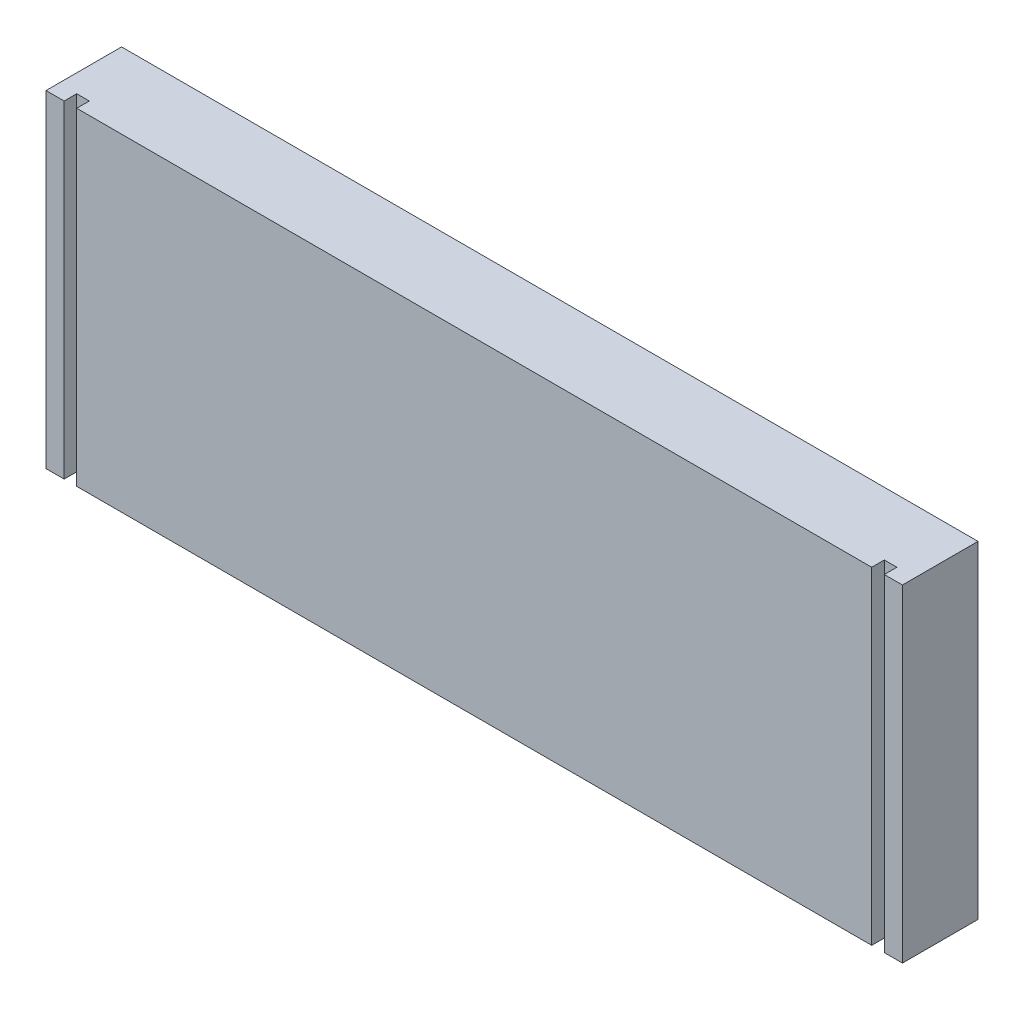
ISO-10303-21;
HEADER;
FILE_DESCRIPTION(('STEP AP214'),'2;1');
FILE_NAME('part.step','',(''),(''),'','','');
FILE_SCHEMA(('AUTOMOTIVE_DESIGN { 1 0 10303 214 1 1 1 1 }'));
ENDSEC;
DATA;
#1=APPLICATION_CONTEXT('core data for automotive mechanical design processes');
#2=APPLICATION_PROTOCOL_DEFINITION('international standard','automotive_design',2000,#1);
#3=PRODUCT_CONTEXT('',#1,'mechanical');
#4=PRODUCT('Part','Part','',(#3));
#5=PRODUCT_RELATED_PRODUCT_CATEGORY('part','',(#4));
#6=PRODUCT_DEFINITION_FORMATION('','',#4);
#7=PRODUCT_DEFINITION_CONTEXT('part definition',#1,'design');
#8=PRODUCT_DEFINITION('design','',#6,#7);
#9=PRODUCT_DEFINITION_SHAPE('','',#8);
#10=(LENGTH_UNIT() NAMED_UNIT(*) SI_UNIT(.MILLI.,.METRE.));
#11=(NAMED_UNIT(*) PLANE_ANGLE_UNIT() SI_UNIT($,.RADIAN.));
#12=(NAMED_UNIT(*) SI_UNIT($,.STERADIAN.) SOLID_ANGLE_UNIT());
#13=UNCERTAINTY_MEASURE_WITH_UNIT(LENGTH_MEASURE(1.E-05),#10,'distance_accuracy_value','');
#14=(GEOMETRIC_REPRESENTATION_CONTEXT(3) GLOBAL_UNCERTAINTY_ASSIGNED_CONTEXT((#13)) GLOBAL_UNIT_ASSIGNED_CONTEXT((#10,
#11,#12)) REPRESENTATION_CONTEXT('',''));
#15=CARTESIAN_POINT('',(0.,0.,0.));
#16=DIRECTION('',(0.,0.,1.));
#17=DIRECTION('',(1.,0.,0.));
#18=AXIS2_PLACEMENT_3D('',#15,#16,#17);
#19=CARTESIAN_POINT('',(-107.95,-41.275,19.05));
#20=DIRECTION('',(0.,1.,0.));
#21=DIRECTION('',(0.,0.,1.));
#22=AXIS2_PLACEMENT_3D('',#19,#20,#21);
#23=PLANE('',#22);
#24=CARTESIAN_POINT('',(-82.55,-41.275,9.525));
#25=DIRECTION('',(0.,-1.,0.));
#26=DIRECTION('',(0.,0.,-1.));
#27=AXIS2_PLACEMENT_3D('',#24,#25,#26);
#28=CIRCLE('',#27,4.7625);
#29=CARTESIAN_POINT('',(-82.55,-41.275,4.7625));
#30=VERTEX_POINT('',#29);
#31=EDGE_CURVE('E291',#30,#30,#28,.T.);
#32=ORIENTED_EDGE('',*,*,#31,.F.);
#33=EDGE_LOOP('',(#32));
#34=FACE_BOUND('',#33,.T.);
#35=CARTESIAN_POINT('',(82.55,-41.275,9.525));
#36=DIRECTION('',(0.,1.,0.));
#37=DIRECTION('',(0.,0.,-1.));
#38=AXIS2_PLACEMENT_3D('',#35,#36,#37);
#39=CIRCLE('',#38,4.7625);
#40=CARTESIAN_POINT('',(82.55,-41.275,4.7625));
#41=VERTEX_POINT('',#40);
#42=EDGE_CURVE('E259',#41,#41,#39,.T.);
#43=ORIENTED_EDGE('',*,*,#42,.T.);
#44=EDGE_LOOP('',(#43));
#45=FACE_BOUND('',#44,.T.);
#46=DIRECTION('',(0.,0.,-1.));
#47=VECTOR('',#46,1.);
#48=CARTESIAN_POINT('',(103.378,-41.275,19.05));
#49=LINE('',#48,#47);
#50=CARTESIAN_POINT('',(103.378,-41.275,19.05));
#51=VERTEX_POINT('',#50);
#52=CARTESIAN_POINT('',(103.378,-41.275,15.875));
#53=VERTEX_POINT('',#52);
#54=EDGE_CURVE('E133',#51,#53,#49,.T.);
#55=ORIENTED_EDGE('',*,*,#54,.T.);
#56=DIRECTION('',(-1.,0.,0.));
#57=VECTOR('',#56,1.);
#58=CARTESIAN_POINT('',(103.378,-41.275,15.875));
#59=LINE('',#58,#57);
#60=CARTESIAN_POINT('',(100.203,-41.275,15.875));
#61=VERTEX_POINT('',#60);
#62=EDGE_CURVE('E145',#53,#61,#59,.T.);
#63=ORIENTED_EDGE('',*,*,#62,.T.);
#64=DIRECTION('',(0.,0.,1.));
#65=VECTOR('',#64,1.);
#66=CARTESIAN_POINT('',(100.203,-41.275,19.05));
#67=LINE('',#66,#65);
#68=CARTESIAN_POINT('',(100.203,-41.275,19.05));
#69=VERTEX_POINT('',#68);
#70=EDGE_CURVE('E257',#61,#69,#67,.T.);
#71=ORIENTED_EDGE('',*,*,#70,.T.);
#72=DIRECTION('',(1.,0.,0.));
#73=VECTOR('',#72,1.);
#74=CARTESIAN_POINT('',(-107.95,-41.275,19.05));
#75=LINE('',#74,#73);
#76=CARTESIAN_POINT('',(-100.203,-41.275,19.05));
#77=VERTEX_POINT('',#76);
#78=EDGE_CURVE('E164',#77,#69,#75,.T.);
#79=ORIENTED_EDGE('',*,*,#78,.F.);
#80=DIRECTION('',(0.,0.,1.));
#81=VECTOR('',#80,1.);
#82=CARTESIAN_POINT('',(-100.203,-41.275,19.05));
#83=LINE('',#82,#81);
#84=CARTESIAN_POINT('',(-100.203,-41.275,15.875));
#85=VERTEX_POINT('',#84);
#86=EDGE_CURVE('E61',#85,#77,#83,.T.);
#87=ORIENTED_EDGE('',*,*,#86,.F.);
#88=DIRECTION('',(1.,0.,0.));
#89=VECTOR('',#88,1.);
#90=CARTESIAN_POINT('',(-103.378,-41.275,15.875));
#91=LINE('',#90,#89);
#92=CARTESIAN_POINT('',(-103.378,-41.275,15.875));
#93=VERTEX_POINT('',#92);
#94=EDGE_CURVE('E285',#93,#85,#91,.T.);
#95=ORIENTED_EDGE('',*,*,#94,.F.);
#96=DIRECTION('',(0.,0.,-1.));
#97=VECTOR('',#96,1.);
#98=CARTESIAN_POINT('',(-103.378,-41.275,19.05));
#99=LINE('',#98,#97);
#100=CARTESIAN_POINT('',(-103.378,-41.275,19.05));
#101=VERTEX_POINT('',#100);
#102=EDGE_CURVE('E271',#101,#93,#99,.T.);
#103=ORIENTED_EDGE('',*,*,#102,.F.);
#104=CARTESIAN_POINT('',(-107.95,-41.275,19.05));
#105=VERTEX_POINT('',#104);
#106=EDGE_CURVE('E166',#105,#101,#75,.T.);
#107=ORIENTED_EDGE('',*,*,#106,.F.);
#108=DIRECTION('',(0.,0.,-1.));
#109=VECTOR('',#108,1.);
#110=CARTESIAN_POINT('',(-107.95,-41.275,19.05));
#111=LINE('',#110,#109);
#112=CARTESIAN_POINT('',(-107.95,-41.275,0.));
#113=VERTEX_POINT('',#112);
#114=EDGE_CURVE('E11',#105,#113,#111,.T.);
#115=ORIENTED_EDGE('',*,*,#114,.T.);
#116=DIRECTION('',(1.,0.,0.));
#117=VECTOR('',#116,1.);
#118=CARTESIAN_POINT('',(-107.95,-41.275,0.));
#119=LINE('',#118,#117);
#120=CARTESIAN_POINT('',(107.95,-41.275,0.));
#121=VERTEX_POINT('',#120);
#122=EDGE_CURVE('E157',#113,#121,#119,.T.);
#123=ORIENTED_EDGE('',*,*,#122,.T.);
#124=DIRECTION('',(0.,0.,-1.));
#125=VECTOR('',#124,1.);
#126=CARTESIAN_POINT('',(107.95,-41.275,19.05));
#127=LINE('',#126,#125);
#128=CARTESIAN_POINT('',(107.95,-41.275,19.05));
#129=VERTEX_POINT('',#128);
#130=EDGE_CURVE('E45',#129,#121,#127,.T.);
#131=ORIENTED_EDGE('',*,*,#130,.F.);
#132=EDGE_CURVE('E163',#51,#129,#75,.T.);
#133=ORIENTED_EDGE('',*,*,#132,.F.);
#134=EDGE_LOOP('',(#55,#63,#71,#79,#87,#95,#103,#107,#115,#123,#131,#133));
#135=FACE_BOUND('',#134,.T.);
#136=ADVANCED_FACE('F36',(#34,#45,#135),#23,.F.);
#137=CARTESIAN_POINT('',(-107.95,41.275,19.05));
#138=DIRECTION('',(0.,1.,0.));
#139=DIRECTION('',(0.,0.,1.));
#140=AXIS2_PLACEMENT_3D('',#137,#138,#139);
#141=PLANE('',#140);
#142=DIRECTION('',(-1.,0.,0.));
#143=VECTOR('',#142,1.);
#144=CARTESIAN_POINT('',(103.378,41.275,15.875));
#145=LINE('',#144,#143);
#146=CARTESIAN_POINT('',(103.378,41.275,15.875));
#147=VERTEX_POINT('',#146);
#148=CARTESIAN_POINT('',(100.203,41.275,15.875));
#149=VERTEX_POINT('',#148);
#150=EDGE_CURVE('E138',#147,#149,#145,.T.);
#151=ORIENTED_EDGE('',*,*,#150,.F.);
#152=DIRECTION('',(0.,0.,-1.));
#153=VECTOR('',#152,1.);
#154=CARTESIAN_POINT('',(103.378,41.275,19.05));
#155=LINE('',#154,#153);
#156=CARTESIAN_POINT('',(103.378,41.275,19.05));
#157=VERTEX_POINT('',#156);
#158=EDGE_CURVE('E130',#157,#147,#155,.T.);
#159=ORIENTED_EDGE('',*,*,#158,.F.);
#160=DIRECTION('',(1.,0.,0.));
#161=VECTOR('',#160,1.);
#162=CARTESIAN_POINT('',(-107.95,41.275,19.05));
#163=LINE('',#162,#161);
#164=CARTESIAN_POINT('',(107.95,41.275,19.05));
#165=VERTEX_POINT('',#164);
#166=EDGE_CURVE('E143',#157,#165,#163,.T.);
#167=ORIENTED_EDGE('',*,*,#166,.T.);
#168=DIRECTION('',(0.,0.,-1.));
#169=VECTOR('',#168,1.);
#170=CARTESIAN_POINT('',(107.95,41.275,19.05));
#171=LINE('',#170,#169);
#172=CARTESIAN_POINT('',(107.95,41.275,0.));
#173=VERTEX_POINT('',#172);
#174=EDGE_CURVE('E181',#165,#173,#171,.T.);
#175=ORIENTED_EDGE('',*,*,#174,.T.);
#176=DIRECTION('',(1.,0.,0.));
#177=VECTOR('',#176,1.);
#178=CARTESIAN_POINT('',(-107.95,41.275,0.));
#179=LINE('',#178,#177);
#180=CARTESIAN_POINT('',(-107.95,41.275,0.));
#181=VERTEX_POINT('',#180);
#182=EDGE_CURVE('E172',#181,#173,#179,.T.);
#183=ORIENTED_EDGE('',*,*,#182,.F.);
#184=DIRECTION('',(0.,0.,-1.));
#185=VECTOR('',#184,1.);
#186=CARTESIAN_POINT('',(-107.95,41.275,19.05));
#187=LINE('',#186,#185);
#188=CARTESIAN_POINT('',(-107.95,41.275,19.05));
#189=VERTEX_POINT('',#188);
#190=EDGE_CURVE('E40',#189,#181,#187,.T.);
#191=ORIENTED_EDGE('',*,*,#190,.F.);
#192=CARTESIAN_POINT('',(-103.378,41.275,19.05));
#193=VERTEX_POINT('',#192);
#194=EDGE_CURVE('E154',#189,#193,#163,.T.);
#195=ORIENTED_EDGE('',*,*,#194,.T.);
#196=DIRECTION('',(0.,0.,-1.));
#197=VECTOR('',#196,1.);
#198=CARTESIAN_POINT('',(-103.378,41.275,19.05));
#199=LINE('',#198,#197);
#200=CARTESIAN_POINT('',(-103.378,41.275,15.875));
#201=VERTEX_POINT('',#200);
#202=EDGE_CURVE('E274',#193,#201,#199,.T.);
#203=ORIENTED_EDGE('',*,*,#202,.T.);
#204=DIRECTION('',(1.,0.,0.));
#205=VECTOR('',#204,1.);
#206=CARTESIAN_POINT('',(-103.378,41.275,15.875));
#207=LINE('',#206,#205);
#208=CARTESIAN_POINT('',(-100.203,41.275,15.875));
#209=VERTEX_POINT('',#208);
#210=EDGE_CURVE('E276',#201,#209,#207,.T.);
#211=ORIENTED_EDGE('',*,*,#210,.T.);
#212=DIRECTION('',(0.,0.,1.));
#213=VECTOR('',#212,1.);
#214=CARTESIAN_POINT('',(-100.203,41.275,19.05));
#215=LINE('',#214,#213);
#216=CARTESIAN_POINT('',(-100.203,41.275,19.05));
#217=VERTEX_POINT('',#216);
#218=EDGE_CURVE('E279',#209,#217,#215,.T.);
#219=ORIENTED_EDGE('',*,*,#218,.T.);
#220=CARTESIAN_POINT('',(100.203,41.275,19.05));
#221=VERTEX_POINT('',#220);
#222=EDGE_CURVE('E151',#217,#221,#163,.T.);
#223=ORIENTED_EDGE('',*,*,#222,.T.);
#224=DIRECTION('',(0.,0.,1.));
#225=VECTOR('',#224,1.);
#226=CARTESIAN_POINT('',(100.203,41.275,19.05));
#227=LINE('',#226,#225);
#228=EDGE_CURVE('E53',#149,#221,#227,.T.);
#229=ORIENTED_EDGE('',*,*,#228,.F.);
#230=EDGE_LOOP('',(#151,#159,#167,#175,#183,#191,#195,#203,#211,#219,#223,#229));
#231=FACE_BOUND('',#230,.T.);
#232=ADVANCED_FACE('F142',(#231),#141,.T.);
#233=CARTESIAN_POINT('',(0.,0.,19.05));
#234=DIRECTION('',(0.,0.,-1.));
#235=DIRECTION('',(-1.,0.,0.));
#236=AXIS2_PLACEMENT_3D('',#233,#234,#235);
#237=PLANE('',#236);
#238=DIRECTION('',(0.,-1.,0.));
#239=VECTOR('',#238,1.);
#240=CARTESIAN_POINT('',(103.378,41.275,19.05));
#241=LINE('',#240,#239);
#242=EDGE_CURVE('E126',#157,#51,#241,.T.);
#243=ORIENTED_EDGE('',*,*,#242,.T.);
#244=ORIENTED_EDGE('',*,*,#132,.T.);
#245=DIRECTION('',(0.,1.,0.));
#246=VECTOR('',#245,1.);
#247=CARTESIAN_POINT('',(107.95,-41.275,19.05));
#248=LINE('',#247,#246);
#249=EDGE_CURVE('E149',#129,#165,#248,.T.);
#250=ORIENTED_EDGE('',*,*,#249,.T.);
#251=ORIENTED_EDGE('',*,*,#166,.F.);
#252=EDGE_LOOP('',(#243,#244,#250,#251));
#253=FACE_BOUND('',#252,.T.);
#254=ADVANCED_FACE('F147',(#253),#237,.F.);
#255=DIRECTION('',(0.,-1.,0.));
#256=VECTOR('',#255,1.);
#257=CARTESIAN_POINT('',(100.203,41.275,19.05));
#258=LINE('',#257,#256);
#259=EDGE_CURVE('E137',#221,#69,#258,.T.);
#260=ORIENTED_EDGE('',*,*,#259,.F.);
#261=ORIENTED_EDGE('',*,*,#222,.F.);
#262=DIRECTION('',(0.,-1.,0.));
#263=VECTOR('',#262,1.);
#264=CARTESIAN_POINT('',(-100.203,41.275,19.05));
#265=LINE('',#264,#263);
#266=EDGE_CURVE('E292',#217,#77,#265,.T.);
#267=ORIENTED_EDGE('',*,*,#266,.T.);
#268=ORIENTED_EDGE('',*,*,#78,.T.);
#269=EDGE_LOOP('',(#260,#261,#267,#268));
#270=FACE_BOUND('',#269,.T.);
#271=ADVANCED_FACE('F215',(#270),#237,.F.);
#272=ORIENTED_EDGE('',*,*,#106,.T.);
#273=DIRECTION('',(0.,-1.,0.));
#274=VECTOR('',#273,1.);
#275=CARTESIAN_POINT('',(-103.378,41.275,19.05));
#276=LINE('',#275,#274);
#277=EDGE_CURVE('E289',#193,#101,#276,.T.);
#278=ORIENTED_EDGE('',*,*,#277,.F.);
#279=ORIENTED_EDGE('',*,*,#194,.F.);
#280=DIRECTION('',(0.,1.,0.));
#281=VECTOR('',#280,1.);
#282=CARTESIAN_POINT('',(-107.95,-41.275,19.05));
#283=LINE('',#282,#281);
#284=EDGE_CURVE('E152',#105,#189,#283,.T.);
#285=ORIENTED_EDGE('',*,*,#284,.F.);
#286=EDGE_LOOP('',(#272,#278,#279,#285));
#287=FACE_BOUND('',#286,.T.);
#288=ADVANCED_FACE('F203',(#287),#237,.F.);
#289=CARTESIAN_POINT('',(-107.95,-41.275,19.05));
#290=DIRECTION('',(-1.,0.,0.));
#291=DIRECTION('',(0.,0.,1.));
#292=AXIS2_PLACEMENT_3D('',#289,#290,#291);
#293=PLANE('',#292);
#294=DIRECTION('',(0.,1.,0.));
#295=VECTOR('',#294,1.);
#296=CARTESIAN_POINT('',(-107.95,-41.275,0.));
#297=LINE('',#296,#295);
#298=EDGE_CURVE('E169',#113,#181,#297,.T.);
#299=ORIENTED_EDGE('',*,*,#298,.F.);
#300=ORIENTED_EDGE('',*,*,#114,.F.);
#301=ORIENTED_EDGE('',*,*,#284,.T.);
#302=ORIENTED_EDGE('',*,*,#190,.T.);
#303=EDGE_LOOP('',(#299,#300,#301,#302));
#304=FACE_BOUND('',#303,.T.);
#305=ADVANCED_FACE('F38',(#304),#293,.T.);
#306=CARTESIAN_POINT('',(107.95,-41.275,19.05));
#307=DIRECTION('',(-1.,0.,0.));
#308=DIRECTION('',(0.,0.,1.));
#309=AXIS2_PLACEMENT_3D('',#306,#307,#308);
#310=PLANE('',#309);
#311=DIRECTION('',(0.,1.,0.));
#312=VECTOR('',#311,1.);
#313=CARTESIAN_POINT('',(107.95,-41.275,0.));
#314=LINE('',#313,#312);
#315=EDGE_CURVE('E176',#121,#173,#314,.T.);
#316=ORIENTED_EDGE('',*,*,#315,.T.);
#317=ORIENTED_EDGE('',*,*,#174,.F.);
#318=ORIENTED_EDGE('',*,*,#249,.F.);
#319=ORIENTED_EDGE('',*,*,#130,.T.);
#320=EDGE_LOOP('',(#316,#317,#318,#319));
#321=FACE_BOUND('',#320,.T.);
#322=ADVANCED_FACE('F194',(#321),#310,.F.);
#323=CARTESIAN_POINT('',(0.,0.,0.));
#324=DIRECTION('',(0.,0.,-1.));
#325=DIRECTION('',(-1.,0.,0.));
#326=AXIS2_PLACEMENT_3D('',#323,#324,#325);
#327=PLANE('',#326);
#328=ORIENTED_EDGE('',*,*,#298,.T.);
#329=ORIENTED_EDGE('',*,*,#182,.T.);
#330=ORIENTED_EDGE('',*,*,#315,.F.);
#331=ORIENTED_EDGE('',*,*,#122,.F.);
#332=EDGE_LOOP('',(#328,#329,#330,#331));
#333=FACE_BOUND('',#332,.T.);
#334=ADVANCED_FACE('F189',(#333),#327,.T.);
#335=CARTESIAN_POINT('',(-82.55,-22.225,9.525));
#336=DIRECTION('',(0.,-1.,0.));
#337=DIRECTION('',(0.,0.,-1.));
#338=AXIS2_PLACEMENT_3D('',#335,#336,#337);
#339=CYLINDRICAL_SURFACE('',#338,4.7625);
#340=CARTESIAN_POINT('',(-82.55,-22.225,9.525));
#341=DIRECTION('',(0.,-1.,0.));
#342=DIRECTION('',(0.,0.,-1.));
#343=AXIS2_PLACEMENT_3D('',#340,#341,#342);
#344=CIRCLE('',#343,4.7625);
#345=CARTESIAN_POINT('',(-82.55,-22.225,4.7625));
#346=VERTEX_POINT('',#345);
#347=EDGE_CURVE('E173',#346,#346,#344,.T.);
#348=ORIENTED_EDGE('',*,*,#347,.F.);
#349=EDGE_LOOP('',(#348));
#350=FACE_BOUND('',#349,.T.);
#351=ORIENTED_EDGE('',*,*,#31,.T.);
#352=EDGE_LOOP('',(#351));
#353=FACE_BOUND('',#352,.T.);
#354=ADVANCED_FACE('F201',(#350,#353),#339,.F.);
#355=CARTESIAN_POINT('',(-82.55,-22.225,9.525));
#356=DIRECTION('',(0.,-1.,0.));
#357=DIRECTION('',(0.,0.,-1.));
#358=AXIS2_PLACEMENT_3D('',#355,#356,#357);
#359=PLANE('',#358);
#360=ORIENTED_EDGE('',*,*,#347,.T.);
#361=EDGE_LOOP('',(#360));
#362=FACE_BOUND('',#361,.T.);
#363=ADVANCED_FACE('F218',(#362),#359,.T.);
#364=CARTESIAN_POINT('',(-103.378,41.275,19.05));
#365=DIRECTION('',(-1.,0.,0.));
#366=DIRECTION('',(0.,0.,1.));
#367=AXIS2_PLACEMENT_3D('',#364,#365,#366);
#368=PLANE('',#367);
#369=ORIENTED_EDGE('',*,*,#102,.T.);
#370=DIRECTION('',(0.,-1.,0.));
#371=VECTOR('',#370,1.);
#372=CARTESIAN_POINT('',(-103.378,41.275,15.875));
#373=LINE('',#372,#371);
#374=EDGE_CURVE('E282',#201,#93,#373,.T.);
#375=ORIENTED_EDGE('',*,*,#374,.F.);
#376=ORIENTED_EDGE('',*,*,#202,.F.);
#377=ORIENTED_EDGE('',*,*,#277,.T.);
#378=EDGE_LOOP('',(#369,#375,#376,#377));
#379=FACE_BOUND('',#378,.T.);
#380=ADVANCED_FACE('F222',(#379),#368,.F.);
#381=CARTESIAN_POINT('',(-100.203,41.275,19.05));
#382=DIRECTION('',(1.,0.,0.));
#383=DIRECTION('',(0.,0.,-1.));
#384=AXIS2_PLACEMENT_3D('',#381,#382,#383);
#385=PLANE('',#384);
#386=ORIENTED_EDGE('',*,*,#86,.T.);
#387=ORIENTED_EDGE('',*,*,#266,.F.);
#388=ORIENTED_EDGE('',*,*,#218,.F.);
#389=DIRECTION('',(0.,-1.,0.));
#390=VECTOR('',#389,1.);
#391=CARTESIAN_POINT('',(-100.203,41.275,15.875));
#392=LINE('',#391,#390);
#393=EDGE_CURVE('E294',#209,#85,#392,.T.);
#394=ORIENTED_EDGE('',*,*,#393,.T.);
#395=EDGE_LOOP('',(#386,#387,#388,#394));
#396=FACE_BOUND('',#395,.T.);
#397=ADVANCED_FACE('F226',(#396),#385,.F.);
#398=CARTESIAN_POINT('',(-103.378,41.275,15.875));
#399=DIRECTION('',(0.,0.,-1.));
#400=DIRECTION('',(-1.,0.,0.));
#401=AXIS2_PLACEMENT_3D('',#398,#399,#400);
#402=PLANE('',#401);
#403=ORIENTED_EDGE('',*,*,#94,.T.);
#404=ORIENTED_EDGE('',*,*,#393,.F.);
#405=ORIENTED_EDGE('',*,*,#210,.F.);
#406=ORIENTED_EDGE('',*,*,#374,.T.);
#407=EDGE_LOOP('',(#403,#404,#405,#406));
#408=FACE_BOUND('',#407,.T.);
#409=ADVANCED_FACE('F228',(#408),#402,.F.);
#410=CARTESIAN_POINT('',(82.55,-22.225,9.525));
#411=DIRECTION('',(0.,-1.,0.));
#412=DIRECTION('',(0.,0.,-1.));
#413=AXIS2_PLACEMENT_3D('',#410,#411,#412);
#414=CYLINDRICAL_SURFACE('',#413,4.7625);
#415=CARTESIAN_POINT('',(82.55,-22.225,9.525));
#416=DIRECTION('',(0.,1.,0.));
#417=DIRECTION('',(0.,0.,-1.));
#418=AXIS2_PLACEMENT_3D('',#415,#416,#417);
#419=CIRCLE('',#418,4.7625);
#420=CARTESIAN_POINT('',(82.55,-22.225,4.7625));
#421=VERTEX_POINT('',#420);
#422=EDGE_CURVE('E268',#421,#421,#419,.T.);
#423=ORIENTED_EDGE('',*,*,#422,.T.);
#424=EDGE_LOOP('',(#423));
#425=FACE_BOUND('',#424,.T.);
#426=ORIENTED_EDGE('',*,*,#42,.F.);
#427=EDGE_LOOP('',(#426));
#428=FACE_BOUND('',#427,.T.);
#429=ADVANCED_FACE('F231',(#425,#428),#414,.F.);
#430=CARTESIAN_POINT('',(82.55,-22.225,9.525));
#431=DIRECTION('',(0.,-1.,0.));
#432=DIRECTION('',(0.,0.,-1.));
#433=AXIS2_PLACEMENT_3D('',#430,#431,#432);
#434=PLANE('',#433);
#435=ORIENTED_EDGE('',*,*,#422,.F.);
#436=EDGE_LOOP('',(#435));
#437=FACE_BOUND('',#436,.T.);
#438=ADVANCED_FACE('F237',(#437),#434,.T.);
#439=CARTESIAN_POINT('',(103.378,41.275,19.05));
#440=DIRECTION('',(-1.,0.,0.));
#441=DIRECTION('',(0.,0.,1.));
#442=AXIS2_PLACEMENT_3D('',#439,#440,#441);
#443=PLANE('',#442);
#444=ORIENTED_EDGE('',*,*,#54,.F.);
#445=ORIENTED_EDGE('',*,*,#242,.F.);
#446=ORIENTED_EDGE('',*,*,#158,.T.);
#447=DIRECTION('',(0.,-1.,0.));
#448=VECTOR('',#447,1.);
#449=CARTESIAN_POINT('',(103.378,41.275,15.875));
#450=LINE('',#449,#448);
#451=EDGE_CURVE('E253',#147,#53,#450,.T.);
#452=ORIENTED_EDGE('',*,*,#451,.T.);
#453=EDGE_LOOP('',(#444,#445,#446,#452));
#454=FACE_BOUND('',#453,.T.);
#455=ADVANCED_FACE('F128',(#454),#443,.T.);
#456=CARTESIAN_POINT('',(103.378,41.275,15.875));
#457=DIRECTION('',(0.,0.,1.));
#458=DIRECTION('',(1.,0.,0.));
#459=AXIS2_PLACEMENT_3D('',#456,#457,#458);
#460=PLANE('',#459);
#461=ORIENTED_EDGE('',*,*,#62,.F.);
#462=ORIENTED_EDGE('',*,*,#451,.F.);
#463=ORIENTED_EDGE('',*,*,#150,.T.);
#464=DIRECTION('',(0.,-1.,0.));
#465=VECTOR('',#464,1.);
#466=CARTESIAN_POINT('',(100.203,41.275,15.875));
#467=LINE('',#466,#465);
#468=EDGE_CURVE('E254',#149,#61,#467,.T.);
#469=ORIENTED_EDGE('',*,*,#468,.T.);
#470=EDGE_LOOP('',(#461,#462,#463,#469));
#471=FACE_BOUND('',#470,.T.);
#472=ADVANCED_FACE('F244',(#471),#460,.T.);
#473=CARTESIAN_POINT('',(100.203,41.275,19.05));
#474=DIRECTION('',(1.,0.,0.));
#475=DIRECTION('',(0.,0.,-1.));
#476=AXIS2_PLACEMENT_3D('',#473,#474,#475);
#477=PLANE('',#476);
#478=ORIENTED_EDGE('',*,*,#70,.F.);
#479=ORIENTED_EDGE('',*,*,#468,.F.);
#480=ORIENTED_EDGE('',*,*,#228,.T.);
#481=ORIENTED_EDGE('',*,*,#259,.T.);
#482=EDGE_LOOP('',(#478,#479,#480,#481));
#483=FACE_BOUND('',#482,.T.);
#484=ADVANCED_FACE('F245',(#483),#477,.T.);
#485=CLOSED_SHELL('',(#136,#232,#254,#271,#288,#305,#322,#334,#354,#363,#380,#397,#409,#429,
#438,#455,#472,#484));
#486=MANIFOLD_SOLID_BREP('B2',#485);
#487=ADVANCED_BREP_SHAPE_REPRESENTATION('',(#18,#486),#14);
#488=SHAPE_DEFINITION_REPRESENTATION(#9,#487);
ENDSEC;
END-ISO-10303-21;
